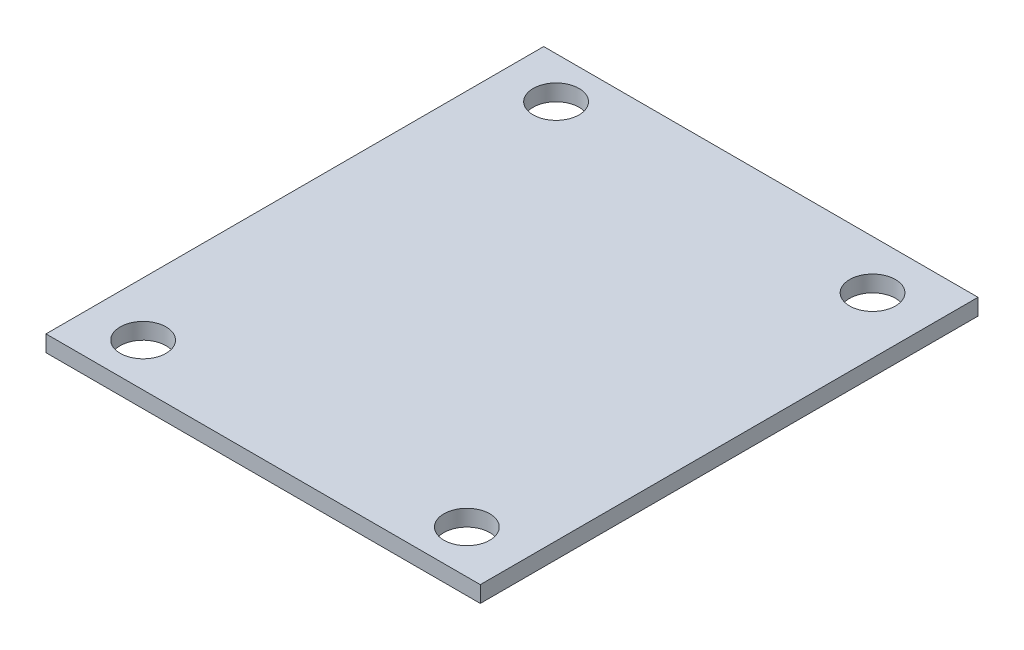
ISO-10303-21;
HEADER;
FILE_DESCRIPTION(('STEP AP214'),'2;1');
FILE_NAME('part.step','',(''),(''),'','','');
FILE_SCHEMA(('AUTOMOTIVE_DESIGN { 1 0 10303 214 1 1 1 1 }'));
ENDSEC;
DATA;
#1=APPLICATION_CONTEXT('core data for automotive mechanical design processes');
#2=APPLICATION_PROTOCOL_DEFINITION('international standard','automotive_design',2000,#1);
#3=PRODUCT_CONTEXT('',#1,'mechanical');
#4=PRODUCT('Part','Part','',(#3));
#5=PRODUCT_RELATED_PRODUCT_CATEGORY('part','',(#4));
#6=PRODUCT_DEFINITION_FORMATION('','',#4);
#7=PRODUCT_DEFINITION_CONTEXT('part definition',#1,'design');
#8=PRODUCT_DEFINITION('design','',#6,#7);
#9=PRODUCT_DEFINITION_SHAPE('','',#8);
#10=(LENGTH_UNIT() NAMED_UNIT(*) SI_UNIT(.MILLI.,.METRE.));
#11=(NAMED_UNIT(*) PLANE_ANGLE_UNIT() SI_UNIT($,.RADIAN.));
#12=(NAMED_UNIT(*) SI_UNIT($,.STERADIAN.) SOLID_ANGLE_UNIT());
#13=UNCERTAINTY_MEASURE_WITH_UNIT(LENGTH_MEASURE(1.E-05),#10,'distance_accuracy_value','');
#14=(GEOMETRIC_REPRESENTATION_CONTEXT(3) GLOBAL_UNCERTAINTY_ASSIGNED_CONTEXT((#13)) GLOBAL_UNIT_ASSIGNED_CONTEXT((#10,
#11,#12)) REPRESENTATION_CONTEXT('',''));
#15=CARTESIAN_POINT('',(0.,0.,0.));
#16=DIRECTION('',(0.,0.,1.));
#17=DIRECTION('',(1.,0.,0.));
#18=AXIS2_PLACEMENT_3D('',#15,#16,#17);
#19=CARTESIAN_POINT('',(-16.1,-1.21,18.45));
#20=DIRECTION('',(-1.,0.,0.));
#21=DIRECTION('',(0.,0.,1.));
#22=AXIS2_PLACEMENT_3D('',#19,#20,#21);
#23=PLANE('',#22);
#24=DIRECTION('',(0.,0.,1.));
#25=VECTOR('',#24,1.);
#26=CARTESIAN_POINT('',(-16.1,0.,18.45));
#27=LINE('',#26,#25);
#28=CARTESIAN_POINT('',(-16.1,0.,-18.45));
#29=VERTEX_POINT('',#28);
#30=CARTESIAN_POINT('',(-16.1,0.,18.45));
#31=VERTEX_POINT('',#30);
#32=EDGE_CURVE('E103',#29,#31,#27,.T.);
#33=ORIENTED_EDGE('',*,*,#32,.F.);
#34=DIRECTION('',(0.,1.,0.));
#35=VECTOR('',#34,1.);
#36=CARTESIAN_POINT('',(-16.1,-1.21,-18.45));
#37=LINE('',#36,#35);
#38=CARTESIAN_POINT('',(-16.1,-1.21,-18.45));
#39=VERTEX_POINT('',#38);
#40=EDGE_CURVE('E11',#39,#29,#37,.T.);
#41=ORIENTED_EDGE('',*,*,#40,.F.);
#42=DIRECTION('',(0.,0.,1.));
#43=VECTOR('',#42,1.);
#44=CARTESIAN_POINT('',(-16.1,-1.21,18.45));
#45=LINE('',#44,#43);
#46=CARTESIAN_POINT('',(-16.1,-1.21,18.45));
#47=VERTEX_POINT('',#46);
#48=EDGE_CURVE('E96',#39,#47,#45,.T.);
#49=ORIENTED_EDGE('',*,*,#48,.T.);
#50=DIRECTION('',(0.,1.,0.));
#51=VECTOR('',#50,1.);
#52=CARTESIAN_POINT('',(-16.1,-1.21,18.45));
#53=LINE('',#52,#51);
#54=EDGE_CURVE('E79',#47,#31,#53,.T.);
#55=ORIENTED_EDGE('',*,*,#54,.T.);
#56=EDGE_LOOP('',(#33,#41,#49,#55));
#57=FACE_BOUND('',#56,.T.);
#58=ADVANCED_FACE('F36',(#57),#23,.T.);
#59=CARTESIAN_POINT('',(16.1,-1.21,-18.45));
#60=DIRECTION('',(0.,0.,-1.));
#61=DIRECTION('',(-1.,0.,0.));
#62=AXIS2_PLACEMENT_3D('',#59,#60,#61);
#63=PLANE('',#62);
#64=DIRECTION('',(-1.,0.,0.));
#65=VECTOR('',#64,1.);
#66=CARTESIAN_POINT('',(16.1,0.,-18.45));
#67=LINE('',#66,#65);
#68=CARTESIAN_POINT('',(16.1,0.,-18.45));
#69=VERTEX_POINT('',#68);
#70=EDGE_CURVE('E98',#69,#29,#67,.T.);
#71=ORIENTED_EDGE('',*,*,#70,.F.);
#72=DIRECTION('',(0.,1.,0.));
#73=VECTOR('',#72,1.);
#74=CARTESIAN_POINT('',(16.1,-1.21,-18.45));
#75=LINE('',#74,#73);
#76=CARTESIAN_POINT('',(16.1,-1.21,-18.45));
#77=VERTEX_POINT('',#76);
#78=EDGE_CURVE('E45',#77,#69,#75,.T.);
#79=ORIENTED_EDGE('',*,*,#78,.F.);
#80=DIRECTION('',(-1.,0.,0.));
#81=VECTOR('',#80,1.);
#82=CARTESIAN_POINT('',(16.1,-1.21,-18.45));
#83=LINE('',#82,#81);
#84=EDGE_CURVE('E93',#77,#39,#83,.T.);
#85=ORIENTED_EDGE('',*,*,#84,.T.);
#86=ORIENTED_EDGE('',*,*,#40,.T.);
#87=EDGE_LOOP('',(#71,#79,#85,#86));
#88=FACE_BOUND('',#87,.T.);
#89=ADVANCED_FACE('F163',(#88),#63,.T.);
#90=CARTESIAN_POINT('',(16.1,-1.21,18.45));
#91=DIRECTION('',(1.,0.,0.));
#92=DIRECTION('',(0.,0.,-1.));
#93=AXIS2_PLACEMENT_3D('',#90,#91,#92);
#94=PLANE('',#93);
#95=DIRECTION('',(0.,0.,-1.));
#96=VECTOR('',#95,1.);
#97=CARTESIAN_POINT('',(16.1,0.,18.45));
#98=LINE('',#97,#96);
#99=CARTESIAN_POINT('',(16.1,0.,18.45));
#100=VERTEX_POINT('',#99);
#101=EDGE_CURVE('E87',#100,#69,#98,.T.);
#102=ORIENTED_EDGE('',*,*,#101,.F.);
#103=DIRECTION('',(0.,1.,0.));
#104=VECTOR('',#103,1.);
#105=CARTESIAN_POINT('',(16.1,-1.21,18.45));
#106=LINE('',#105,#104);
#107=CARTESIAN_POINT('',(16.1,-1.21,18.45));
#108=VERTEX_POINT('',#107);
#109=EDGE_CURVE('E82',#108,#100,#106,.T.);
#110=ORIENTED_EDGE('',*,*,#109,.F.);
#111=DIRECTION('',(0.,0.,-1.));
#112=VECTOR('',#111,1.);
#113=CARTESIAN_POINT('',(16.1,-1.21,18.45));
#114=LINE('',#113,#112);
#115=EDGE_CURVE('E85',#108,#77,#114,.T.);
#116=ORIENTED_EDGE('',*,*,#115,.T.);
#117=ORIENTED_EDGE('',*,*,#78,.T.);
#118=EDGE_LOOP('',(#102,#110,#116,#117));
#119=FACE_BOUND('',#118,.T.);
#120=ADVANCED_FACE('F84',(#119),#94,.T.);
#121=CARTESIAN_POINT('',(16.1,-1.21,18.45));
#122=DIRECTION('',(0.,0.,1.));
#123=DIRECTION('',(1.,0.,0.));
#124=AXIS2_PLACEMENT_3D('',#121,#122,#123);
#125=PLANE('',#124);
#126=DIRECTION('',(1.,0.,0.));
#127=VECTOR('',#126,1.);
#128=CARTESIAN_POINT('',(16.1,0.,18.45));
#129=LINE('',#128,#127);
#130=EDGE_CURVE('E106',#31,#100,#129,.T.);
#131=ORIENTED_EDGE('',*,*,#130,.F.);
#132=ORIENTED_EDGE('',*,*,#54,.F.);
#133=DIRECTION('',(1.,0.,0.));
#134=VECTOR('',#133,1.);
#135=CARTESIAN_POINT('',(16.1,-1.21,18.45));
#136=LINE('',#135,#134);
#137=EDGE_CURVE('E92',#47,#108,#136,.T.);
#138=ORIENTED_EDGE('',*,*,#137,.T.);
#139=ORIENTED_EDGE('',*,*,#109,.T.);
#140=EDGE_LOOP('',(#131,#132,#138,#139));
#141=FACE_BOUND('',#140,.T.);
#142=ADVANCED_FACE('F95',(#141),#125,.T.);
#143=CARTESIAN_POINT('',(0.,-1.21,0.));
#144=DIRECTION('',(0.,1.,0.));
#145=DIRECTION('',(0.,0.,1.));
#146=AXIS2_PLACEMENT_3D('',#143,#144,#145);
#147=PLANE('',#146);
#148=CARTESIAN_POINT('',(11.9,-1.21,15.2482947059323));
#149=DIRECTION('',(0.,-1.,0.));
#150=DIRECTION('',(0.,0.,-1.));
#151=AXIS2_PLACEMENT_3D('',#148,#149,#150);
#152=CIRCLE('',#151,1.69999999999999);
#153=CARTESIAN_POINT('',(11.9,-1.21,13.5482947059323));
#154=VERTEX_POINT('',#153);
#155=EDGE_CURVE('E134',#154,#154,#152,.T.);
#156=ORIENTED_EDGE('',*,*,#155,.F.);
#157=EDGE_LOOP('',(#156));
#158=FACE_BOUND('',#157,.T.);
#159=CARTESIAN_POINT('',(-12.1,-1.21,15.2482947059323));
#160=DIRECTION('',(0.,-1.,0.));
#161=DIRECTION('',(0.,0.,-1.));
#162=AXIS2_PLACEMENT_3D('',#159,#160,#161);
#163=CIRCLE('',#162,1.69999999999999);
#164=CARTESIAN_POINT('',(-12.1,-1.21,13.5482947059323));
#165=VERTEX_POINT('',#164);
#166=EDGE_CURVE('E128',#165,#165,#163,.T.);
#167=ORIENTED_EDGE('',*,*,#166,.F.);
#168=EDGE_LOOP('',(#167));
#169=FACE_BOUND('',#168,.T.);
#170=CARTESIAN_POINT('',(-12.1,-1.21,-15.3708798831218));
#171=DIRECTION('',(0.,-1.,0.));
#172=DIRECTION('',(0.,0.,-1.));
#173=AXIS2_PLACEMENT_3D('',#170,#171,#172);
#174=CIRCLE('',#173,1.69999999999999);
#175=CARTESIAN_POINT('',(-12.1,-1.21,-17.0708798831218));
#176=VERTEX_POINT('',#175);
#177=EDGE_CURVE('E121',#176,#176,#174,.T.);
#178=ORIENTED_EDGE('',*,*,#177,.F.);
#179=EDGE_LOOP('',(#178));
#180=FACE_BOUND('',#179,.T.);
#181=CARTESIAN_POINT('',(11.9,-1.21,-14.832508940561));
#182=DIRECTION('',(0.,-1.,0.));
#183=DIRECTION('',(0.,0.,-1.));
#184=AXIS2_PLACEMENT_3D('',#181,#182,#183);
#185=CIRCLE('',#184,1.69999999999999);
#186=CARTESIAN_POINT('',(11.9,-1.21,-16.532508940561));
#187=VERTEX_POINT('',#186);
#188=EDGE_CURVE('E114',#187,#187,#185,.T.);
#189=ORIENTED_EDGE('',*,*,#188,.F.);
#190=EDGE_LOOP('',(#189));
#191=FACE_BOUND('',#190,.T.);
#192=ORIENTED_EDGE('',*,*,#48,.F.);
#193=ORIENTED_EDGE('',*,*,#84,.F.);
#194=ORIENTED_EDGE('',*,*,#115,.F.);
#195=ORIENTED_EDGE('',*,*,#137,.F.);
#196=EDGE_LOOP('',(#192,#193,#194,#195));
#197=FACE_BOUND('',#196,.T.);
#198=ADVANCED_FACE('F91',(#158,#169,#180,#191,#197),#147,.F.);
#199=CARTESIAN_POINT('',(0.,0.,0.));
#200=DIRECTION('',(0.,1.,0.));
#201=DIRECTION('',(0.,0.,1.));
#202=AXIS2_PLACEMENT_3D('',#199,#200,#201);
#203=PLANE('',#202);
#204=CARTESIAN_POINT('',(11.9,0.,15.2482947059323));
#205=DIRECTION('',(0.,1.,0.));
#206=DIRECTION('',(0.,0.,1.));
#207=AXIS2_PLACEMENT_3D('',#204,#205,#206);
#208=CIRCLE('',#207,1.69999999999999);
#209=CARTESIAN_POINT('',(11.9,0.,16.9482947059322));
#210=VERTEX_POINT('',#209);
#211=EDGE_CURVE('E131',#210,#210,#208,.T.);
#212=ORIENTED_EDGE('',*,*,#211,.F.);
#213=EDGE_LOOP('',(#212));
#214=FACE_BOUND('',#213,.T.);
#215=CARTESIAN_POINT('',(-12.1,0.,15.2482947059323));
#216=DIRECTION('',(0.,1.,0.));
#217=DIRECTION('',(0.,0.,1.));
#218=AXIS2_PLACEMENT_3D('',#215,#216,#217);
#219=CIRCLE('',#218,1.69999999999999);
#220=CARTESIAN_POINT('',(-12.1,0.,16.9482947059322));
#221=VERTEX_POINT('',#220);
#222=EDGE_CURVE('E125',#221,#221,#219,.T.);
#223=ORIENTED_EDGE('',*,*,#222,.F.);
#224=EDGE_LOOP('',(#223));
#225=FACE_BOUND('',#224,.T.);
#226=CARTESIAN_POINT('',(-12.1,0.,-15.3708798831218));
#227=DIRECTION('',(0.,1.,0.));
#228=DIRECTION('',(0.,0.,1.));
#229=AXIS2_PLACEMENT_3D('',#226,#227,#228);
#230=CIRCLE('',#229,1.69999999999999);
#231=CARTESIAN_POINT('',(-12.1,0.,-13.6708798831218));
#232=VERTEX_POINT('',#231);
#233=EDGE_CURVE('E39',#232,#232,#230,.T.);
#234=ORIENTED_EDGE('',*,*,#233,.F.);
#235=EDGE_LOOP('',(#234));
#236=FACE_BOUND('',#235,.T.);
#237=CARTESIAN_POINT('',(11.9,0.,-14.832508940561));
#238=DIRECTION('',(0.,1.,0.));
#239=DIRECTION('',(0.,0.,1.));
#240=AXIS2_PLACEMENT_3D('',#237,#238,#239);
#241=CIRCLE('',#240,1.69999999999999);
#242=CARTESIAN_POINT('',(11.9,0.,-13.132508940561));
#243=VERTEX_POINT('',#242);
#244=EDGE_CURVE('E107',#243,#243,#241,.T.);
#245=ORIENTED_EDGE('',*,*,#244,.F.);
#246=EDGE_LOOP('',(#245));
#247=FACE_BOUND('',#246,.T.);
#248=ORIENTED_EDGE('',*,*,#32,.T.);
#249=ORIENTED_EDGE('',*,*,#130,.T.);
#250=ORIENTED_EDGE('',*,*,#101,.T.);
#251=ORIENTED_EDGE('',*,*,#70,.T.);
#252=EDGE_LOOP('',(#248,#249,#250,#251));
#253=FACE_BOUND('',#252,.T.);
#254=ADVANCED_FACE('F142',(#214,#225,#236,#247,#253),#203,.T.);
#255=CARTESIAN_POINT('',(11.9,-1.21,-14.832508940561));
#256=DIRECTION('',(0.,-1.,0.));
#257=DIRECTION('',(0.,0.,-1.));
#258=AXIS2_PLACEMENT_3D('',#255,#256,#257);
#259=CYLINDRICAL_SURFACE('',#258,1.69999999999999);
#260=ORIENTED_EDGE('',*,*,#244,.T.);
#261=EDGE_LOOP('',(#260));
#262=FACE_BOUND('',#261,.T.);
#263=ORIENTED_EDGE('',*,*,#188,.T.);
#264=EDGE_LOOP('',(#263));
#265=FACE_BOUND('',#264,.T.);
#266=ADVANCED_FACE('F152',(#262,#265),#259,.F.);
#267=CARTESIAN_POINT('',(-12.1,-1.21,-15.3708798831218));
#268=DIRECTION('',(0.,-1.,0.));
#269=DIRECTION('',(0.,0.,-1.));
#270=AXIS2_PLACEMENT_3D('',#267,#268,#269);
#271=CYLINDRICAL_SURFACE('',#270,1.69999999999999);
#272=ORIENTED_EDGE('',*,*,#233,.T.);
#273=EDGE_LOOP('',(#272));
#274=FACE_BOUND('',#273,.T.);
#275=ORIENTED_EDGE('',*,*,#177,.T.);
#276=EDGE_LOOP('',(#275));
#277=FACE_BOUND('',#276,.T.);
#278=ADVANCED_FACE('F149',(#274,#277),#271,.F.);
#279=CARTESIAN_POINT('',(-12.1,-1.21,15.2482947059323));
#280=DIRECTION('',(0.,-1.,0.));
#281=DIRECTION('',(0.,0.,-1.));
#282=AXIS2_PLACEMENT_3D('',#279,#280,#281);
#283=CYLINDRICAL_SURFACE('',#282,1.69999999999999);
#284=ORIENTED_EDGE('',*,*,#222,.T.);
#285=EDGE_LOOP('',(#284));
#286=FACE_BOUND('',#285,.T.);
#287=ORIENTED_EDGE('',*,*,#166,.T.);
#288=EDGE_LOOP('',(#287));
#289=FACE_BOUND('',#288,.T.);
#290=ADVANCED_FACE('F151',(#286,#289),#283,.F.);
#291=CARTESIAN_POINT('',(11.9,-1.21,15.2482947059323));
#292=DIRECTION('',(0.,-1.,0.));
#293=DIRECTION('',(0.,0.,-1.));
#294=AXIS2_PLACEMENT_3D('',#291,#292,#293);
#295=CYLINDRICAL_SURFACE('',#294,1.69999999999999);
#296=ORIENTED_EDGE('',*,*,#211,.T.);
#297=EDGE_LOOP('',(#296));
#298=FACE_BOUND('',#297,.T.);
#299=ORIENTED_EDGE('',*,*,#155,.T.);
#300=EDGE_LOOP('',(#299));
#301=FACE_BOUND('',#300,.T.);
#302=ADVANCED_FACE('F138',(#298,#301),#295,.F.);
#303=CLOSED_SHELL('',(#58,#89,#120,#142,#198,#254,#266,#278,#290,#302));
#304=MANIFOLD_SOLID_BREP('B2',#303);
#305=ADVANCED_BREP_SHAPE_REPRESENTATION('',(#18,#304),#14);
#306=SHAPE_DEFINITION_REPRESENTATION(#9,#305);
ENDSEC;
END-ISO-10303-21;
